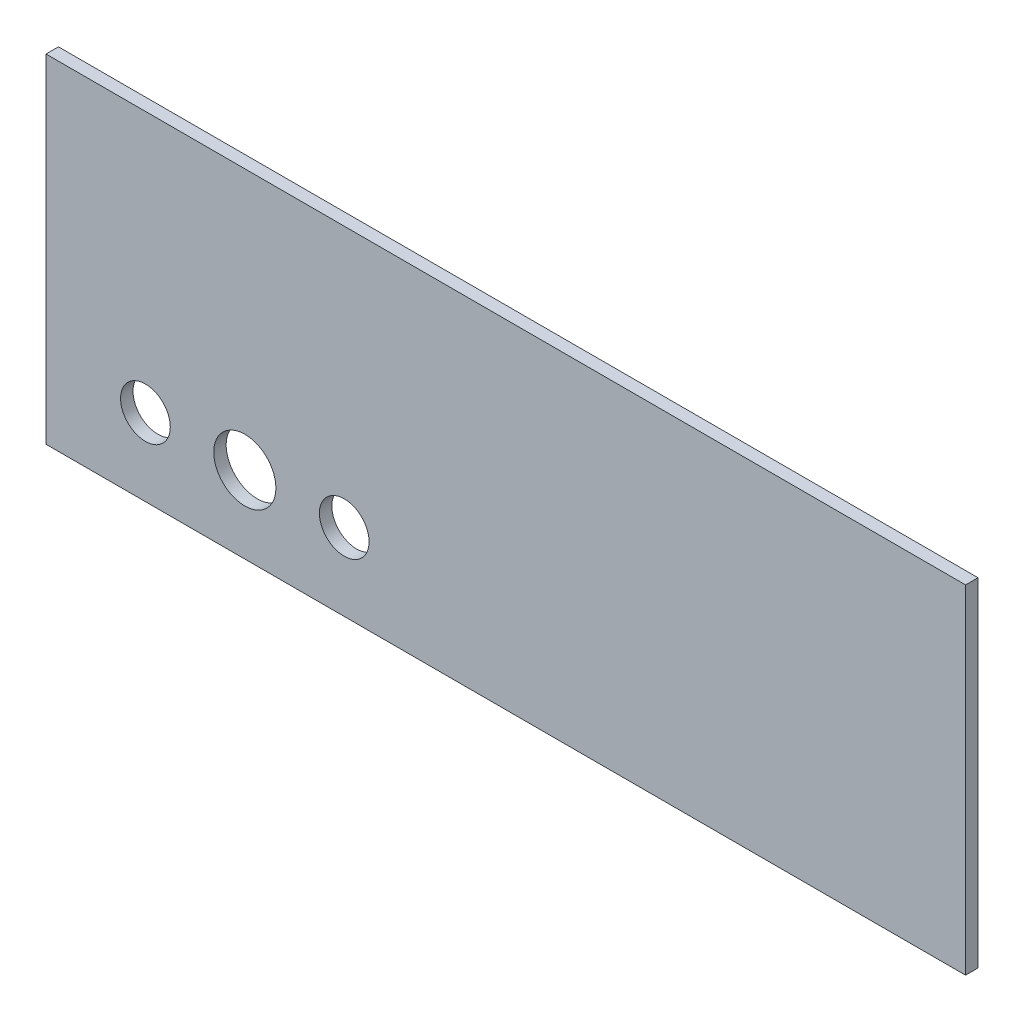
ISO-10303-21;
HEADER;
FILE_DESCRIPTION(('STEP AP214'),'2;1');
FILE_NAME('part.step','',(''),(''),'','','');
FILE_SCHEMA(('AUTOMOTIVE_DESIGN { 1 0 10303 214 1 1 1 1 }'));
ENDSEC;
DATA;
#1=APPLICATION_CONTEXT('core data for automotive mechanical design processes');
#2=APPLICATION_PROTOCOL_DEFINITION('international standard','automotive_design',2000,#1);
#3=PRODUCT_CONTEXT('',#1,'mechanical');
#4=PRODUCT('Part','Part','',(#3));
#5=PRODUCT_RELATED_PRODUCT_CATEGORY('part','',(#4));
#6=PRODUCT_DEFINITION_FORMATION('','',#4);
#7=PRODUCT_DEFINITION_CONTEXT('part definition',#1,'design');
#8=PRODUCT_DEFINITION('design','',#6,#7);
#9=PRODUCT_DEFINITION_SHAPE('','',#8);
#10=(LENGTH_UNIT() NAMED_UNIT(*) SI_UNIT(.MILLI.,.METRE.));
#11=(NAMED_UNIT(*) PLANE_ANGLE_UNIT() SI_UNIT($,.RADIAN.));
#12=(NAMED_UNIT(*) SI_UNIT($,.STERADIAN.) SOLID_ANGLE_UNIT());
#13=UNCERTAINTY_MEASURE_WITH_UNIT(LENGTH_MEASURE(1.E-05),#10,'distance_accuracy_value','');
#14=(GEOMETRIC_REPRESENTATION_CONTEXT(3) GLOBAL_UNCERTAINTY_ASSIGNED_CONTEXT((#13)) GLOBAL_UNIT_ASSIGNED_CONTEXT((#10,
#11,#12)) REPRESENTATION_CONTEXT('',''));
#15=CARTESIAN_POINT('',(0.,0.,0.));
#16=DIRECTION('',(0.,0.,1.));
#17=DIRECTION('',(1.,0.,0.));
#18=AXIS2_PLACEMENT_3D('',#15,#16,#17);
#19=CARTESIAN_POINT('',(117.475,-43.18,-3.175));
#20=DIRECTION('',(1.,0.,0.));
#21=DIRECTION('',(0.,0.,-1.));
#22=AXIS2_PLACEMENT_3D('',#19,#20,#21);
#23=PLANE('',#22);
#24=DIRECTION('',(0.,1.,0.));
#25=VECTOR('',#24,1.);
#26=CARTESIAN_POINT('',(117.475,-43.18,0.));
#27=LINE('',#26,#25);
#28=CARTESIAN_POINT('',(117.475,-43.18,0.));
#29=VERTEX_POINT('',#28);
#30=CARTESIAN_POINT('',(117.475,43.18,0.));
#31=VERTEX_POINT('',#30);
#32=EDGE_CURVE('E103',#29,#31,#27,.T.);
#33=ORIENTED_EDGE('',*,*,#32,.F.);
#34=DIRECTION('',(0.,0.,1.));
#35=VECTOR('',#34,1.);
#36=CARTESIAN_POINT('',(117.475,-43.18,-3.175));
#37=LINE('',#36,#35);
#38=CARTESIAN_POINT('',(117.475,-43.18,-3.175));
#39=VERTEX_POINT('',#38);
#40=EDGE_CURVE('E11',#39,#29,#37,.T.);
#41=ORIENTED_EDGE('',*,*,#40,.F.);
#42=DIRECTION('',(0.,1.,0.));
#43=VECTOR('',#42,1.);
#44=CARTESIAN_POINT('',(117.475,-43.18,-3.175));
#45=LINE('',#44,#43);
#46=CARTESIAN_POINT('',(117.475,43.18,-3.175));
#47=VERTEX_POINT('',#46);
#48=EDGE_CURVE('E96',#39,#47,#45,.T.);
#49=ORIENTED_EDGE('',*,*,#48,.T.);
#50=DIRECTION('',(0.,0.,1.));
#51=VECTOR('',#50,1.);
#52=CARTESIAN_POINT('',(117.475,43.18,-3.175));
#53=LINE('',#52,#51);
#54=EDGE_CURVE('E41',#47,#31,#53,.T.);
#55=ORIENTED_EDGE('',*,*,#54,.T.);
#56=EDGE_LOOP('',(#33,#41,#49,#55));
#57=FACE_BOUND('',#56,.T.);
#58=ADVANCED_FACE('F38',(#57),#23,.T.);
#59=CARTESIAN_POINT('',(-117.475,-43.18,-3.175));
#60=DIRECTION('',(0.,-1.,0.));
#61=DIRECTION('',(0.,0.,-1.));
#62=AXIS2_PLACEMENT_3D('',#59,#60,#61);
#63=PLANE('',#62);
#64=DIRECTION('',(1.,0.,0.));
#65=VECTOR('',#64,1.);
#66=CARTESIAN_POINT('',(-117.475,-43.18,0.));
#67=LINE('',#66,#65);
#68=CARTESIAN_POINT('',(-117.475,-43.18,0.));
#69=VERTEX_POINT('',#68);
#70=EDGE_CURVE('E98',#69,#29,#67,.T.);
#71=ORIENTED_EDGE('',*,*,#70,.F.);
#72=DIRECTION('',(0.,0.,1.));
#73=VECTOR('',#72,1.);
#74=CARTESIAN_POINT('',(-117.475,-43.18,-3.175));
#75=LINE('',#74,#73);
#76=CARTESIAN_POINT('',(-117.475,-43.18,-3.175));
#77=VERTEX_POINT('',#76);
#78=EDGE_CURVE('E47',#77,#69,#75,.T.);
#79=ORIENTED_EDGE('',*,*,#78,.F.);
#80=DIRECTION('',(1.,0.,0.));
#81=VECTOR('',#80,1.);
#82=CARTESIAN_POINT('',(-117.475,-43.18,-3.175));
#83=LINE('',#82,#81);
#84=EDGE_CURVE('E93',#77,#39,#83,.T.);
#85=ORIENTED_EDGE('',*,*,#84,.T.);
#86=ORIENTED_EDGE('',*,*,#40,.T.);
#87=EDGE_LOOP('',(#71,#79,#85,#86));
#88=FACE_BOUND('',#87,.T.);
#89=ADVANCED_FACE('F114',(#88),#63,.T.);
#90=CARTESIAN_POINT('',(-117.475,-43.18,-3.175));
#91=DIRECTION('',(-1.,0.,0.));
#92=DIRECTION('',(0.,0.,1.));
#93=AXIS2_PLACEMENT_3D('',#90,#91,#92);
#94=PLANE('',#93);
#95=DIRECTION('',(0.,-1.,0.));
#96=VECTOR('',#95,1.);
#97=CARTESIAN_POINT('',(-117.475,-43.18,0.));
#98=LINE('',#97,#96);
#99=CARTESIAN_POINT('',(-117.475,43.18,0.));
#100=VERTEX_POINT('',#99);
#101=EDGE_CURVE('E88',#100,#69,#98,.T.);
#102=ORIENTED_EDGE('',*,*,#101,.F.);
#103=DIRECTION('',(0.,0.,1.));
#104=VECTOR('',#103,1.);
#105=CARTESIAN_POINT('',(-117.475,43.18,-3.175));
#106=LINE('',#105,#104);
#107=CARTESIAN_POINT('',(-117.475,43.18,-3.175));
#108=VERTEX_POINT('',#107);
#109=EDGE_CURVE('E83',#108,#100,#106,.T.);
#110=ORIENTED_EDGE('',*,*,#109,.F.);
#111=DIRECTION('',(0.,-1.,0.));
#112=VECTOR('',#111,1.);
#113=CARTESIAN_POINT('',(-117.475,-43.18,-3.175));
#114=LINE('',#113,#112);
#115=EDGE_CURVE('E86',#108,#77,#114,.T.);
#116=ORIENTED_EDGE('',*,*,#115,.T.);
#117=ORIENTED_EDGE('',*,*,#78,.T.);
#118=EDGE_LOOP('',(#102,#110,#116,#117));
#119=FACE_BOUND('',#118,.T.);
#120=ADVANCED_FACE('F85',(#119),#94,.T.);
#121=CARTESIAN_POINT('',(-117.475,43.18,-3.175));
#122=DIRECTION('',(0.,1.,0.));
#123=DIRECTION('',(0.,0.,1.));
#124=AXIS2_PLACEMENT_3D('',#121,#122,#123);
#125=PLANE('',#124);
#126=DIRECTION('',(-1.,0.,0.));
#127=VECTOR('',#126,1.);
#128=CARTESIAN_POINT('',(-117.475,43.18,0.));
#129=LINE('',#128,#127);
#130=EDGE_CURVE('E106',#31,#100,#129,.T.);
#131=ORIENTED_EDGE('',*,*,#130,.F.);
#132=ORIENTED_EDGE('',*,*,#54,.F.);
#133=DIRECTION('',(-1.,0.,0.));
#134=VECTOR('',#133,1.);
#135=CARTESIAN_POINT('',(-117.475,43.18,-3.175));
#136=LINE('',#135,#134);
#137=EDGE_CURVE('E92',#47,#108,#136,.T.);
#138=ORIENTED_EDGE('',*,*,#137,.T.);
#139=ORIENTED_EDGE('',*,*,#109,.T.);
#140=EDGE_LOOP('',(#131,#132,#138,#139));
#141=FACE_BOUND('',#140,.T.);
#142=ADVANCED_FACE('F95',(#141),#125,.T.);
#143=CARTESIAN_POINT('',(0.,0.,-3.175));
#144=DIRECTION('',(0.,0.,-1.));
#145=DIRECTION('',(-1.,0.,0.));
#146=AXIS2_PLACEMENT_3D('',#143,#144,#145);
#147=PLANE('',#146);
#148=CARTESIAN_POINT('',(-92.075,-23.495,-3.175));
#149=DIRECTION('',(0.,0.,1.));
#150=DIRECTION('',(1.,0.,0.));
#151=AXIS2_PLACEMENT_3D('',#148,#149,#150);
#152=CIRCLE('',#151,6.35);
#153=CARTESIAN_POINT('',(-85.725,-23.495,-3.175));
#154=VERTEX_POINT('',#153);
#155=EDGE_CURVE('E151',#154,#154,#152,.T.);
#156=ORIENTED_EDGE('',*,*,#155,.T.);
#157=EDGE_LOOP('',(#156));
#158=FACE_BOUND('',#157,.T.);
#159=CARTESIAN_POINT('',(-41.275,-23.495,-3.175));
#160=DIRECTION('',(0.,0.,1.));
#161=DIRECTION('',(1.,0.,0.));
#162=AXIS2_PLACEMENT_3D('',#159,#160,#161);
#163=CIRCLE('',#162,6.35);
#164=CARTESIAN_POINT('',(-34.925,-23.495,-3.175));
#165=VERTEX_POINT('',#164);
#166=EDGE_CURVE('E159',#165,#165,#163,.T.);
#167=ORIENTED_EDGE('',*,*,#166,.T.);
#168=EDGE_LOOP('',(#167));
#169=FACE_BOUND('',#168,.T.);
#170=CARTESIAN_POINT('',(-66.675,-23.495,-3.175));
#171=DIRECTION('',(0.,0.,1.));
#172=DIRECTION('',(1.,0.,0.));
#173=AXIS2_PLACEMENT_3D('',#170,#171,#172);
#174=CIRCLE('',#173,7.9375);
#175=CARTESIAN_POINT('',(-58.7375,-23.495,-3.175));
#176=VERTEX_POINT('',#175);
#177=EDGE_CURVE('E107',#176,#176,#174,.T.);
#178=ORIENTED_EDGE('',*,*,#177,.T.);
#179=EDGE_LOOP('',(#178));
#180=FACE_BOUND('',#179,.T.);
#181=ORIENTED_EDGE('',*,*,#48,.F.);
#182=ORIENTED_EDGE('',*,*,#84,.F.);
#183=ORIENTED_EDGE('',*,*,#115,.F.);
#184=ORIENTED_EDGE('',*,*,#137,.F.);
#185=EDGE_LOOP('',(#181,#182,#183,#184));
#186=FACE_BOUND('',#185,.T.);
#187=ADVANCED_FACE('F91',(#158,#169,#180,#186),#147,.T.);
#188=CARTESIAN_POINT('',(0.,0.,0.));
#189=DIRECTION('',(0.,0.,-1.));
#190=DIRECTION('',(-1.,0.,0.));
#191=AXIS2_PLACEMENT_3D('',#188,#189,#190);
#192=PLANE('',#191);
#193=CARTESIAN_POINT('',(-92.075,-23.495,0.));
#194=DIRECTION('',(0.,0.,1.));
#195=DIRECTION('',(1.,0.,0.));
#196=AXIS2_PLACEMENT_3D('',#193,#194,#195);
#197=CIRCLE('',#196,6.35);
#198=CARTESIAN_POINT('',(-85.725,-23.495,0.));
#199=VERTEX_POINT('',#198);
#200=EDGE_CURVE('E154',#199,#199,#197,.T.);
#201=ORIENTED_EDGE('',*,*,#200,.F.);
#202=EDGE_LOOP('',(#201));
#203=FACE_BOUND('',#202,.T.);
#204=CARTESIAN_POINT('',(-41.275,-23.495,0.));
#205=DIRECTION('',(0.,0.,1.));
#206=DIRECTION('',(1.,0.,0.));
#207=AXIS2_PLACEMENT_3D('',#204,#205,#206);
#208=CIRCLE('',#207,6.35);
#209=CARTESIAN_POINT('',(-34.925,-23.495,0.));
#210=VERTEX_POINT('',#209);
#211=EDGE_CURVE('E156',#210,#210,#208,.T.);
#212=ORIENTED_EDGE('',*,*,#211,.F.);
#213=EDGE_LOOP('',(#212));
#214=FACE_BOUND('',#213,.T.);
#215=CARTESIAN_POINT('',(-66.675,-23.495,0.));
#216=DIRECTION('',(0.,0.,1.));
#217=DIRECTION('',(1.,0.,0.));
#218=AXIS2_PLACEMENT_3D('',#215,#216,#217);
#219=CIRCLE('',#218,7.9375);
#220=CARTESIAN_POINT('',(-58.7375,-23.495,0.));
#221=VERTEX_POINT('',#220);
#222=EDGE_CURVE('E162',#221,#221,#219,.T.);
#223=ORIENTED_EDGE('',*,*,#222,.F.);
#224=EDGE_LOOP('',(#223));
#225=FACE_BOUND('',#224,.T.);
#226=ORIENTED_EDGE('',*,*,#32,.T.);
#227=ORIENTED_EDGE('',*,*,#130,.T.);
#228=ORIENTED_EDGE('',*,*,#101,.T.);
#229=ORIENTED_EDGE('',*,*,#70,.T.);
#230=EDGE_LOOP('',(#226,#227,#228,#229));
#231=FACE_BOUND('',#230,.T.);
#232=ADVANCED_FACE('F113',(#203,#214,#225,#231),#192,.F.);
#233=CARTESIAN_POINT('',(-66.675,-23.495,-3.175));
#234=DIRECTION('',(0.,0.,1.));
#235=DIRECTION('',(1.,0.,0.));
#236=AXIS2_PLACEMENT_3D('',#233,#234,#235);
#237=CYLINDRICAL_SURFACE('',#236,7.9375);
#238=ORIENTED_EDGE('',*,*,#177,.F.);
#239=EDGE_LOOP('',(#238));
#240=FACE_BOUND('',#239,.T.);
#241=ORIENTED_EDGE('',*,*,#222,.T.);
#242=EDGE_LOOP('',(#241));
#243=FACE_BOUND('',#242,.T.);
#244=ADVANCED_FACE('F132',(#240,#243),#237,.F.);
#245=CARTESIAN_POINT('',(-41.275,-23.495,-3.175));
#246=DIRECTION('',(0.,0.,1.));
#247=DIRECTION('',(1.,0.,0.));
#248=AXIS2_PLACEMENT_3D('',#245,#246,#247);
#249=CYLINDRICAL_SURFACE('',#248,6.35);
#250=ORIENTED_EDGE('',*,*,#166,.F.);
#251=EDGE_LOOP('',(#250));
#252=FACE_BOUND('',#251,.T.);
#253=ORIENTED_EDGE('',*,*,#211,.T.);
#254=EDGE_LOOP('',(#253));
#255=FACE_BOUND('',#254,.T.);
#256=ADVANCED_FACE('F139',(#252,#255),#249,.F.);
#257=CARTESIAN_POINT('',(-92.075,-23.495,-3.175));
#258=DIRECTION('',(0.,0.,1.));
#259=DIRECTION('',(1.,0.,0.));
#260=AXIS2_PLACEMENT_3D('',#257,#258,#259);
#261=CYLINDRICAL_SURFACE('',#260,6.35);
#262=ORIENTED_EDGE('',*,*,#155,.F.);
#263=EDGE_LOOP('',(#262));
#264=FACE_BOUND('',#263,.T.);
#265=ORIENTED_EDGE('',*,*,#200,.T.);
#266=EDGE_LOOP('',(#265));
#267=FACE_BOUND('',#266,.T.);
#268=ADVANCED_FACE('F143',(#264,#267),#261,.F.);
#269=CLOSED_SHELL('',(#58,#89,#120,#142,#187,#232,#244,#256,#268));
#270=MANIFOLD_SOLID_BREP('B2',#269);
#271=ADVANCED_BREP_SHAPE_REPRESENTATION('',(#18,#270),#14);
#272=SHAPE_DEFINITION_REPRESENTATION(#9,#271);
ENDSEC;
END-ISO-10303-21;
